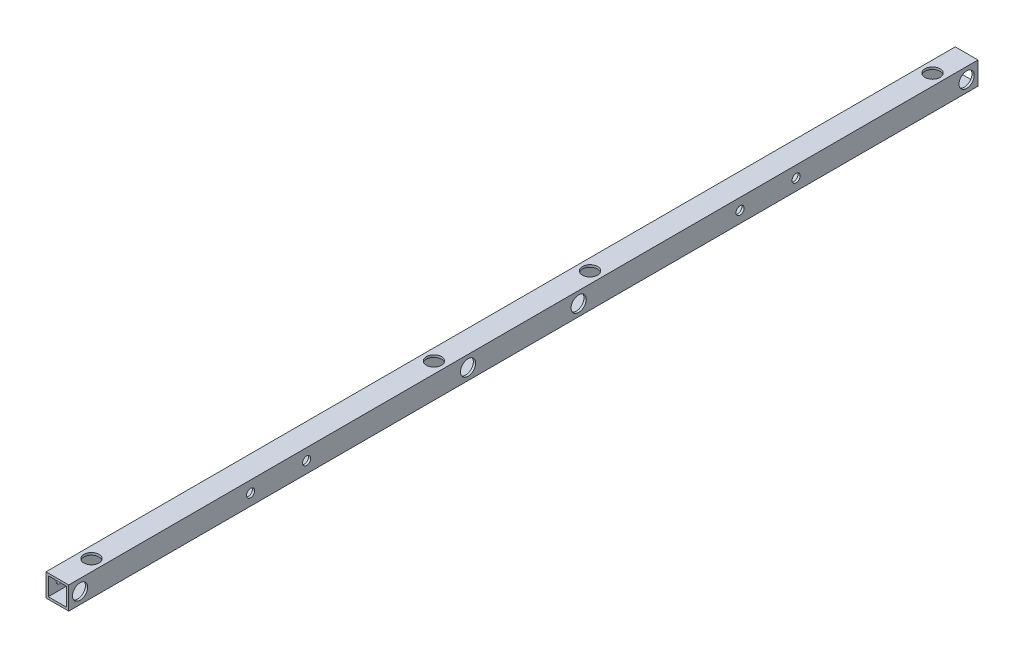
ISO-10303-21;
HEADER;
FILE_DESCRIPTION(('STEP AP214'),'2;1');
FILE_NAME('part.step','',(''),(''),'','','');
FILE_SCHEMA(('AUTOMOTIVE_DESIGN { 1 0 10303 214 1 1 1 1 }'));
ENDSEC;
DATA;
#1=APPLICATION_CONTEXT('core data for automotive mechanical design processes');
#2=APPLICATION_PROTOCOL_DEFINITION('international standard','automotive_design',2000,#1);
#3=PRODUCT_CONTEXT('',#1,'mechanical');
#4=PRODUCT('Part','Part','',(#3));
#5=PRODUCT_RELATED_PRODUCT_CATEGORY('part','',(#4));
#6=PRODUCT_DEFINITION_FORMATION('','',#4);
#7=PRODUCT_DEFINITION_CONTEXT('part definition',#1,'design');
#8=PRODUCT_DEFINITION('design','',#6,#7);
#9=PRODUCT_DEFINITION_SHAPE('','',#8);
#10=(LENGTH_UNIT() NAMED_UNIT(*) SI_UNIT(.MILLI.,.METRE.));
#11=(NAMED_UNIT(*) PLANE_ANGLE_UNIT() SI_UNIT($,.RADIAN.));
#12=(NAMED_UNIT(*) SI_UNIT($,.STERADIAN.) SOLID_ANGLE_UNIT());
#13=UNCERTAINTY_MEASURE_WITH_UNIT(LENGTH_MEASURE(1.E-05),#10,'distance_accuracy_value','');
#14=(GEOMETRIC_REPRESENTATION_CONTEXT(3) GLOBAL_UNCERTAINTY_ASSIGNED_CONTEXT((#13)) GLOBAL_UNIT_ASSIGNED_CONTEXT((#10,
#11,#12)) REPRESENTATION_CONTEXT('',''));
#15=CARTESIAN_POINT('',(0.,0.,0.));
#16=DIRECTION('',(0.,0.,1.));
#17=DIRECTION('',(1.,0.,0.));
#18=AXIS2_PLACEMENT_3D('',#15,#16,#17);
#19=CARTESIAN_POINT('',(0.,0.,600.));
#20=DIRECTION('',(0.,0.,-1.));
#21=DIRECTION('',(-1.,0.,0.));
#22=AXIS2_PLACEMENT_3D('',#19,#20,#21);
#23=PLANE('',#22);
#24=DIRECTION('',(0.,1.,0.));
#25=VECTOR('',#24,1.);
#26=CARTESIAN_POINT('',(7.5,-7.5,600.));
#27=LINE('',#26,#25);
#28=CARTESIAN_POINT('',(7.5,-7.5,600.));
#29=VERTEX_POINT('',#28);
#30=CARTESIAN_POINT('',(7.5,7.5,600.));
#31=VERTEX_POINT('',#30);
#32=EDGE_CURVE('E158',#29,#31,#27,.T.);
#33=ORIENTED_EDGE('',*,*,#32,.T.);
#34=DIRECTION('',(-1.,0.,0.));
#35=VECTOR('',#34,1.);
#36=CARTESIAN_POINT('',(-7.5,7.5,600.));
#37=LINE('',#36,#35);
#38=CARTESIAN_POINT('',(-7.5,7.5,600.));
#39=VERTEX_POINT('',#38);
#40=EDGE_CURVE('E161',#31,#39,#37,.T.);
#41=ORIENTED_EDGE('',*,*,#40,.T.);
#42=DIRECTION('',(0.,-1.,0.));
#43=VECTOR('',#42,1.);
#44=CARTESIAN_POINT('',(-7.5,-7.5,600.));
#45=LINE('',#44,#43);
#46=CARTESIAN_POINT('',(-7.5,-7.5,600.));
#47=VERTEX_POINT('',#46);
#48=EDGE_CURVE('E164',#39,#47,#45,.T.);
#49=ORIENTED_EDGE('',*,*,#48,.T.);
#50=DIRECTION('',(1.,0.,0.));
#51=VECTOR('',#50,1.);
#52=CARTESIAN_POINT('',(-7.5,-7.5,600.));
#53=LINE('',#52,#51);
#54=EDGE_CURVE('E166',#47,#29,#53,.T.);
#55=ORIENTED_EDGE('',*,*,#54,.T.);
#56=EDGE_LOOP('',(#33,#41,#49,#55));
#57=FACE_BOUND('',#56,.T.);
#58=DIRECTION('',(0.,1.,0.));
#59=VECTOR('',#58,1.);
#60=CARTESIAN_POINT('',(6.,-6.,600.));
#61=LINE('',#60,#59);
#62=CARTESIAN_POINT('',(6.,-6.,600.));
#63=VERTEX_POINT('',#62);
#64=CARTESIAN_POINT('',(6.,6.,600.));
#65=VERTEX_POINT('',#64);
#66=EDGE_CURVE('E120',#63,#65,#61,.T.);
#67=ORIENTED_EDGE('',*,*,#66,.F.);
#68=DIRECTION('',(1.,0.,0.));
#69=VECTOR('',#68,1.);
#70=CARTESIAN_POINT('',(-6.,-6.,600.));
#71=LINE('',#70,#69);
#72=CARTESIAN_POINT('',(-6.,-6.,600.));
#73=VERTEX_POINT('',#72);
#74=EDGE_CURVE('E142',#73,#63,#71,.T.);
#75=ORIENTED_EDGE('',*,*,#74,.F.);
#76=DIRECTION('',(0.,-1.,0.));
#77=VECTOR('',#76,1.);
#78=CARTESIAN_POINT('',(-6.,-6.,600.));
#79=LINE('',#78,#77);
#80=CARTESIAN_POINT('',(-6.,6.,600.));
#81=VERTEX_POINT('',#80);
#82=EDGE_CURVE('E140',#81,#73,#79,.T.);
#83=ORIENTED_EDGE('',*,*,#82,.F.);
#84=DIRECTION('',(-1.,0.,0.));
#85=VECTOR('',#84,1.);
#86=CARTESIAN_POINT('',(-6.,6.,600.));
#87=LINE('',#86,#85);
#88=EDGE_CURVE('E128',#65,#81,#87,.T.);
#89=ORIENTED_EDGE('',*,*,#88,.F.);
#90=EDGE_LOOP('',(#67,#75,#83,#89));
#91=FACE_BOUND('',#90,.T.);
#92=ADVANCED_FACE('F53',(#57,#91),#23,.F.);
#93=CARTESIAN_POINT('',(0.,0.,0.));
#94=DIRECTION('',(0.,0.,-1.));
#95=DIRECTION('',(-1.,0.,0.));
#96=AXIS2_PLACEMENT_3D('',#93,#94,#95);
#97=PLANE('',#96);
#98=DIRECTION('',(0.,1.,0.));
#99=VECTOR('',#98,1.);
#100=CARTESIAN_POINT('',(7.5,-7.5,0.));
#101=LINE('',#100,#99);
#102=CARTESIAN_POINT('',(7.5,-7.5,0.));
#103=VERTEX_POINT('',#102);
#104=CARTESIAN_POINT('',(7.5,7.5,0.));
#105=VERTEX_POINT('',#104);
#106=EDGE_CURVE('E136',#103,#105,#101,.T.);
#107=ORIENTED_EDGE('',*,*,#106,.F.);
#108=DIRECTION('',(1.,0.,0.));
#109=VECTOR('',#108,1.);
#110=CARTESIAN_POINT('',(-7.5,-7.5,0.));
#111=LINE('',#110,#109);
#112=CARTESIAN_POINT('',(-7.5,-7.5,0.));
#113=VERTEX_POINT('',#112);
#114=EDGE_CURVE('E162',#113,#103,#111,.T.);
#115=ORIENTED_EDGE('',*,*,#114,.F.);
#116=DIRECTION('',(0.,-1.,0.));
#117=VECTOR('',#116,1.);
#118=CARTESIAN_POINT('',(-7.5,-7.5,0.));
#119=LINE('',#118,#117);
#120=CARTESIAN_POINT('',(-7.5,7.5,0.));
#121=VERTEX_POINT('',#120);
#122=EDGE_CURVE('E173',#121,#113,#119,.T.);
#123=ORIENTED_EDGE('',*,*,#122,.F.);
#124=DIRECTION('',(-1.,0.,0.));
#125=VECTOR('',#124,1.);
#126=CARTESIAN_POINT('',(-7.5,7.5,0.));
#127=LINE('',#126,#125);
#128=EDGE_CURVE('E171',#105,#121,#127,.T.);
#129=ORIENTED_EDGE('',*,*,#128,.F.);
#130=EDGE_LOOP('',(#107,#115,#123,#129));
#131=FACE_BOUND('',#130,.T.);
#132=DIRECTION('',(1.,0.,0.));
#133=VECTOR('',#132,1.);
#134=CARTESIAN_POINT('',(-6.,-6.,0.));
#135=LINE('',#134,#133);
#136=CARTESIAN_POINT('',(-6.,-6.,0.));
#137=VERTEX_POINT('',#136);
#138=CARTESIAN_POINT('',(6.,-6.,0.));
#139=VERTEX_POINT('',#138);
#140=EDGE_CURVE('E129',#137,#139,#135,.T.);
#141=ORIENTED_EDGE('',*,*,#140,.T.);
#142=DIRECTION('',(0.,1.,0.));
#143=VECTOR('',#142,1.);
#144=CARTESIAN_POINT('',(6.,-6.,0.));
#145=LINE('',#144,#143);
#146=CARTESIAN_POINT('',(6.,6.,0.));
#147=VERTEX_POINT('',#146);
#148=EDGE_CURVE('E78',#139,#147,#145,.T.);
#149=ORIENTED_EDGE('',*,*,#148,.T.);
#150=DIRECTION('',(-1.,0.,0.));
#151=VECTOR('',#150,1.);
#152=CARTESIAN_POINT('',(-6.,6.,0.));
#153=LINE('',#152,#151);
#154=CARTESIAN_POINT('',(-6.,6.,0.));
#155=VERTEX_POINT('',#154);
#156=EDGE_CURVE('E135',#147,#155,#153,.T.);
#157=ORIENTED_EDGE('',*,*,#156,.T.);
#158=DIRECTION('',(0.,-1.,0.));
#159=VECTOR('',#158,1.);
#160=CARTESIAN_POINT('',(-6.,-6.,0.));
#161=LINE('',#160,#159);
#162=EDGE_CURVE('E150',#155,#137,#161,.T.);
#163=ORIENTED_EDGE('',*,*,#162,.T.);
#164=EDGE_LOOP('',(#141,#149,#157,#163));
#165=FACE_BOUND('',#164,.T.);
#166=ADVANCED_FACE('F336',(#131,#165),#97,.T.);
#167=CARTESIAN_POINT('',(7.5,-7.5,600.));
#168=DIRECTION('',(-1.,0.,0.));
#169=DIRECTION('',(0.,0.,1.));
#170=AXIS2_PLACEMENT_3D('',#167,#168,#169);
#171=PLANE('',#170);
#172=CARTESIAN_POINT('',(7.5,0.,480.));
#173=DIRECTION('',(1.,0.,0.));
#174=DIRECTION('',(0.,0.,-1.));
#175=AXIS2_PLACEMENT_3D('',#172,#173,#174);
#176=CIRCLE('',#175,2.69999999999996);
#177=CARTESIAN_POINT('',(7.5,0.,477.3));
#178=VERTEX_POINT('',#177);
#179=EDGE_CURVE('E269',#178,#178,#176,.T.);
#180=ORIENTED_EDGE('',*,*,#179,.F.);
#181=EDGE_LOOP('',(#180));
#182=FACE_BOUND('',#181,.T.);
#183=CARTESIAN_POINT('',(7.5,0.,443.));
#184=DIRECTION('',(1.,0.,0.));
#185=DIRECTION('',(0.,0.,-1.));
#186=AXIS2_PLACEMENT_3D('',#183,#184,#185);
#187=CIRCLE('',#186,2.69999999999996);
#188=CARTESIAN_POINT('',(7.5,0.,440.3));
#189=VERTEX_POINT('',#188);
#190=EDGE_CURVE('E261',#189,#189,#187,.T.);
#191=ORIENTED_EDGE('',*,*,#190,.F.);
#192=EDGE_LOOP('',(#191));
#193=FACE_BOUND('',#192,.T.);
#194=CARTESIAN_POINT('',(7.5,0.,157.));
#195=DIRECTION('',(1.,0.,0.));
#196=DIRECTION('',(0.,0.,-1.));
#197=AXIS2_PLACEMENT_3D('',#194,#195,#196);
#198=CIRCLE('',#197,2.70000000000001);
#199=CARTESIAN_POINT('',(7.5,0.,154.3));
#200=VERTEX_POINT('',#199);
#201=EDGE_CURVE('E256',#200,#200,#198,.T.);
#202=ORIENTED_EDGE('',*,*,#201,.F.);
#203=EDGE_LOOP('',(#202));
#204=FACE_BOUND('',#203,.T.);
#205=CARTESIAN_POINT('',(7.5,0.,120.));
#206=DIRECTION('',(1.,0.,0.));
#207=DIRECTION('',(0.,0.,-1.));
#208=AXIS2_PLACEMENT_3D('',#205,#206,#207);
#209=CIRCLE('',#208,2.7);
#210=CARTESIAN_POINT('',(7.5,0.,117.3));
#211=VERTEX_POINT('',#210);
#212=EDGE_CURVE('E252',#211,#211,#209,.T.);
#213=ORIENTED_EDGE('',*,*,#212,.F.);
#214=EDGE_LOOP('',(#213));
#215=FACE_BOUND('',#214,.T.);
#216=CARTESIAN_POINT('',(7.5,0.,592.5));
#217=DIRECTION('',(1.,0.,0.));
#218=DIRECTION('',(0.,0.,-1.));
#219=AXIS2_PLACEMENT_3D('',#216,#217,#218);
#220=CIRCLE('',#219,5.00000000000004);
#221=CARTESIAN_POINT('',(7.5,0.,587.5));
#222=VERTEX_POINT('',#221);
#223=EDGE_CURVE('E231',#222,#222,#220,.T.);
#224=ORIENTED_EDGE('',*,*,#223,.F.);
#225=EDGE_LOOP('',(#224));
#226=FACE_BOUND('',#225,.T.);
#227=CARTESIAN_POINT('',(7.5,0.,336.5));
#228=DIRECTION('',(1.,0.,0.));
#229=DIRECTION('',(0.,0.,-1.));
#230=AXIS2_PLACEMENT_3D('',#227,#228,#229);
#231=CIRCLE('',#230,4.99999999999999);
#232=CARTESIAN_POINT('',(7.5,0.,331.5));
#233=VERTEX_POINT('',#232);
#234=EDGE_CURVE('E281',#233,#233,#231,.T.);
#235=ORIENTED_EDGE('',*,*,#234,.F.);
#236=EDGE_LOOP('',(#235));
#237=FACE_BOUND('',#236,.T.);
#238=CARTESIAN_POINT('',(7.5,0.,263.5));
#239=DIRECTION('',(1.,0.,0.));
#240=DIRECTION('',(0.,0.,-1.));
#241=AXIS2_PLACEMENT_3D('',#238,#239,#240);
#242=CIRCLE('',#241,4.99999999999999);
#243=CARTESIAN_POINT('',(7.5,0.,258.5));
#244=VERTEX_POINT('',#243);
#245=EDGE_CURVE('E284',#244,#244,#242,.T.);
#246=ORIENTED_EDGE('',*,*,#245,.F.);
#247=EDGE_LOOP('',(#246));
#248=FACE_BOUND('',#247,.T.);
#249=CARTESIAN_POINT('',(7.5,0.,7.5));
#250=DIRECTION('',(1.,0.,0.));
#251=DIRECTION('',(0.,0.,-1.));
#252=AXIS2_PLACEMENT_3D('',#249,#250,#251);
#253=CIRCLE('',#252,5.);
#254=CARTESIAN_POINT('',(7.5,0.,2.5));
#255=VERTEX_POINT('',#254);
#256=EDGE_CURVE('E278',#255,#255,#253,.T.);
#257=ORIENTED_EDGE('',*,*,#256,.F.);
#258=EDGE_LOOP('',(#257));
#259=FACE_BOUND('',#258,.T.);
#260=ORIENTED_EDGE('',*,*,#106,.T.);
#261=DIRECTION('',(0.,0.,-1.));
#262=VECTOR('',#261,1.);
#263=CARTESIAN_POINT('',(7.5,7.5,600.));
#264=LINE('',#263,#262);
#265=EDGE_CURVE('E13',#31,#105,#264,.T.);
#266=ORIENTED_EDGE('',*,*,#265,.F.);
#267=ORIENTED_EDGE('',*,*,#32,.F.);
#268=DIRECTION('',(0.,0.,-1.));
#269=VECTOR('',#268,1.);
#270=CARTESIAN_POINT('',(7.5,-7.5,600.));
#271=LINE('',#270,#269);
#272=EDGE_CURVE('E168',#29,#103,#271,.T.);
#273=ORIENTED_EDGE('',*,*,#272,.T.);
#274=EDGE_LOOP('',(#260,#266,#267,#273));
#275=FACE_BOUND('',#274,.T.);
#276=ADVANCED_FACE('F55',(#182,#193,#204,#215,#226,#237,#248,#259,#275),#171,.F.);
#277=CARTESIAN_POINT('',(-7.5,7.5,600.));
#278=DIRECTION('',(0.,-1.,0.));
#279=DIRECTION('',(0.,0.,-1.));
#280=AXIS2_PLACEMENT_3D('',#277,#278,#279);
#281=PLANE('',#280);
#282=CARTESIAN_POINT('',(0.,7.5,577.5));
#283=DIRECTION('',(0.,1.,0.));
#284=DIRECTION('',(0.,0.,1.));
#285=AXIS2_PLACEMENT_3D('',#282,#283,#284);
#286=CIRCLE('',#285,5.);
#287=CARTESIAN_POINT('',(0.,7.5,582.5));
#288=VERTEX_POINT('',#287);
#289=EDGE_CURVE('E219',#288,#288,#286,.T.);
#290=ORIENTED_EDGE('',*,*,#289,.F.);
#291=EDGE_LOOP('',(#290));
#292=FACE_BOUND('',#291,.T.);
#293=CARTESIAN_POINT('',(-7.75236273748183E-13,7.5,351.5));
#294=DIRECTION('',(0.,1.,0.));
#295=DIRECTION('',(0.,0.,1.));
#296=AXIS2_PLACEMENT_3D('',#293,#294,#295);
#297=CIRCLE('',#296,5.);
#298=CARTESIAN_POINT('',(-7.75236273748183E-13,7.5,356.5));
#299=VERTEX_POINT('',#298);
#300=EDGE_CURVE('E291',#299,#299,#297,.T.);
#301=ORIENTED_EDGE('',*,*,#300,.F.);
#302=EDGE_LOOP('',(#301));
#303=FACE_BOUND('',#302,.T.);
#304=CARTESIAN_POINT('',(7.7497107641725E-13,7.5,248.5));
#305=DIRECTION('',(0.,1.,0.));
#306=DIRECTION('',(0.,0.,1.));
#307=AXIS2_PLACEMENT_3D('',#304,#305,#306);
#308=CIRCLE('',#307,5.);
#309=CARTESIAN_POINT('',(7.7497107641725E-13,7.5,253.5));
#310=VERTEX_POINT('',#309);
#311=EDGE_CURVE('E294',#310,#310,#308,.T.);
#312=ORIENTED_EDGE('',*,*,#311,.F.);
#313=EDGE_LOOP('',(#312));
#314=FACE_BOUND('',#313,.T.);
#315=CARTESIAN_POINT('',(0.,7.5,22.5));
#316=DIRECTION('',(0.,1.,0.));
#317=DIRECTION('',(0.,0.,1.));
#318=AXIS2_PLACEMENT_3D('',#315,#316,#317);
#319=CIRCLE('',#318,5.);
#320=CARTESIAN_POINT('',(0.,7.5,27.5));
#321=VERTEX_POINT('',#320);
#322=EDGE_CURVE('E240',#321,#321,#319,.T.);
#323=ORIENTED_EDGE('',*,*,#322,.F.);
#324=EDGE_LOOP('',(#323));
#325=FACE_BOUND('',#324,.T.);
#326=ORIENTED_EDGE('',*,*,#128,.T.);
#327=DIRECTION('',(0.,0.,-1.));
#328=VECTOR('',#327,1.);
#329=CARTESIAN_POINT('',(-7.5,7.5,600.));
#330=LINE('',#329,#328);
#331=EDGE_CURVE('E62',#39,#121,#330,.T.);
#332=ORIENTED_EDGE('',*,*,#331,.F.);
#333=ORIENTED_EDGE('',*,*,#40,.F.);
#334=ORIENTED_EDGE('',*,*,#265,.T.);
#335=EDGE_LOOP('',(#326,#332,#333,#334));
#336=FACE_BOUND('',#335,.T.);
#337=ADVANCED_FACE('F351',(#292,#303,#314,#325,#336),#281,.F.);
#338=CARTESIAN_POINT('',(-7.5,-7.5,600.));
#339=DIRECTION('',(1.,0.,0.));
#340=DIRECTION('',(0.,0.,-1.));
#341=AXIS2_PLACEMENT_3D('',#338,#339,#340);
#342=PLANE('',#341);
#343=CARTESIAN_POINT('',(-7.5,0.,120.));
#344=DIRECTION('',(-1.,0.,0.));
#345=DIRECTION('',(0.,0.,1.));
#346=AXIS2_PLACEMENT_3D('',#343,#344,#345);
#347=CIRCLE('',#346,5.);
#348=CARTESIAN_POINT('',(-7.5,0.,125.));
#349=VERTEX_POINT('',#348);
#350=EDGE_CURVE('E245',#349,#349,#347,.T.);
#351=ORIENTED_EDGE('',*,*,#350,.F.);
#352=EDGE_LOOP('',(#351));
#353=FACE_BOUND('',#352,.T.);
#354=CARTESIAN_POINT('',(-7.5,0.,157.));
#355=DIRECTION('',(-1.,0.,0.));
#356=DIRECTION('',(0.,0.,1.));
#357=AXIS2_PLACEMENT_3D('',#354,#355,#356);
#358=CIRCLE('',#357,4.99999999999999);
#359=CARTESIAN_POINT('',(-7.5,0.,162.));
#360=VERTEX_POINT('',#359);
#361=EDGE_CURVE('E612',#360,#360,#358,.T.);
#362=ORIENTED_EDGE('',*,*,#361,.F.);
#363=EDGE_LOOP('',(#362));
#364=FACE_BOUND('',#363,.T.);
#365=CARTESIAN_POINT('',(-7.5,0.,443.));
#366=DIRECTION('',(-1.,0.,0.));
#367=DIRECTION('',(0.,0.,1.));
#368=AXIS2_PLACEMENT_3D('',#365,#366,#367);
#369=CIRCLE('',#368,4.99999999999999);
#370=CARTESIAN_POINT('',(-7.5,0.,448.));
#371=VERTEX_POINT('',#370);
#372=EDGE_CURVE('E615',#371,#371,#369,.T.);
#373=ORIENTED_EDGE('',*,*,#372,.F.);
#374=EDGE_LOOP('',(#373));
#375=FACE_BOUND('',#374,.T.);
#376=CARTESIAN_POINT('',(-7.5,0.,480.));
#377=DIRECTION('',(-1.,0.,0.));
#378=DIRECTION('',(0.,0.,1.));
#379=AXIS2_PLACEMENT_3D('',#376,#377,#378);
#380=CIRCLE('',#379,4.99999999999999);
#381=CARTESIAN_POINT('',(-7.5,0.,485.));
#382=VERTEX_POINT('',#381);
#383=EDGE_CURVE('E620',#382,#382,#380,.T.);
#384=ORIENTED_EDGE('',*,*,#383,.F.);
#385=EDGE_LOOP('',(#384));
#386=FACE_BOUND('',#385,.T.);
#387=CARTESIAN_POINT('',(-7.5,0.,592.5));
#388=DIRECTION('',(1.,0.,0.));
#389=DIRECTION('',(0.,0.,-1.));
#390=AXIS2_PLACEMENT_3D('',#387,#388,#389);
#391=CIRCLE('',#390,2.25000000000001);
#392=CARTESIAN_POINT('',(-7.5,0.,590.25));
#393=VERTEX_POINT('',#392);
#394=EDGE_CURVE('E148',#393,#393,#391,.T.);
#395=ORIENTED_EDGE('',*,*,#394,.T.);
#396=EDGE_LOOP('',(#395));
#397=FACE_BOUND('',#396,.T.);
#398=CARTESIAN_POINT('',(-7.5,0.,263.5));
#399=DIRECTION('',(1.,0.,0.));
#400=DIRECTION('',(0.,0.,-1.));
#401=AXIS2_PLACEMENT_3D('',#398,#399,#400);
#402=CIRCLE('',#401,2.24999999999995);
#403=CARTESIAN_POINT('',(-7.5,0.,261.25));
#404=VERTEX_POINT('',#403);
#405=EDGE_CURVE('E195',#404,#404,#402,.T.);
#406=ORIENTED_EDGE('',*,*,#405,.T.);
#407=EDGE_LOOP('',(#406));
#408=FACE_BOUND('',#407,.T.);
#409=CARTESIAN_POINT('',(-7.5,0.,7.5));
#410=DIRECTION('',(1.,0.,0.));
#411=DIRECTION('',(0.,0.,-1.));
#412=AXIS2_PLACEMENT_3D('',#409,#410,#411);
#413=CIRCLE('',#412,2.25);
#414=CARTESIAN_POINT('',(-7.5,0.,5.25));
#415=VERTEX_POINT('',#414);
#416=EDGE_CURVE('E191',#415,#415,#413,.T.);
#417=ORIENTED_EDGE('',*,*,#416,.T.);
#418=EDGE_LOOP('',(#417));
#419=FACE_BOUND('',#418,.T.);
#420=CARTESIAN_POINT('',(-7.5,0.,336.5));
#421=DIRECTION('',(1.,0.,0.));
#422=DIRECTION('',(0.,0.,-1.));
#423=AXIS2_PLACEMENT_3D('',#420,#421,#422);
#424=CIRCLE('',#423,2.24999999999995);
#425=CARTESIAN_POINT('',(-7.5,0.,334.25));
#426=VERTEX_POINT('',#425);
#427=EDGE_CURVE('E186',#426,#426,#424,.T.);
#428=ORIENTED_EDGE('',*,*,#427,.T.);
#429=EDGE_LOOP('',(#428));
#430=FACE_BOUND('',#429,.T.);
#431=ORIENTED_EDGE('',*,*,#122,.T.);
#432=DIRECTION('',(0.,0.,-1.));
#433=VECTOR('',#432,1.);
#434=CARTESIAN_POINT('',(-7.5,-7.5,600.));
#435=LINE('',#434,#433);
#436=EDGE_CURVE('E178',#47,#113,#435,.T.);
#437=ORIENTED_EDGE('',*,*,#436,.F.);
#438=ORIENTED_EDGE('',*,*,#48,.F.);
#439=ORIENTED_EDGE('',*,*,#331,.T.);
#440=EDGE_LOOP('',(#431,#437,#438,#439));
#441=FACE_BOUND('',#440,.T.);
#442=ADVANCED_FACE('F315',(#353,#364,#375,#386,#397,#408,#419,#430,#441),#342,.F.);
#443=CARTESIAN_POINT('',(-7.5,-7.5,600.));
#444=DIRECTION('',(0.,1.,0.));
#445=DIRECTION('',(0.,0.,1.));
#446=AXIS2_PLACEMENT_3D('',#443,#444,#445);
#447=PLANE('',#446);
#448=CARTESIAN_POINT('',(0.,-7.5,577.5));
#449=DIRECTION('',(0.,1.,0.));
#450=DIRECTION('',(0.,0.,1.));
#451=AXIS2_PLACEMENT_3D('',#448,#449,#450);
#452=CIRCLE('',#451,2.24999999999998);
#453=CARTESIAN_POINT('',(0.,-7.5,579.75));
#454=VERTEX_POINT('',#453);
#455=EDGE_CURVE('E187',#454,#454,#452,.T.);
#456=ORIENTED_EDGE('',*,*,#455,.T.);
#457=EDGE_LOOP('',(#456));
#458=FACE_BOUND('',#457,.T.);
#459=CARTESIAN_POINT('',(0.,-7.5,22.5));
#460=DIRECTION('',(0.,1.,0.));
#461=DIRECTION('',(0.,0.,1.));
#462=AXIS2_PLACEMENT_3D('',#459,#460,#461);
#463=CIRCLE('',#462,2.25);
#464=CARTESIAN_POINT('',(0.,-7.5,24.75));
#465=VERTEX_POINT('',#464);
#466=EDGE_CURVE('E211',#465,#465,#463,.T.);
#467=ORIENTED_EDGE('',*,*,#466,.T.);
#468=EDGE_LOOP('',(#467));
#469=FACE_BOUND('',#468,.T.);
#470=CARTESIAN_POINT('',(7.7497107641725E-13,-7.5,248.5));
#471=DIRECTION('',(0.,1.,0.));
#472=DIRECTION('',(0.,0.,1.));
#473=AXIS2_PLACEMENT_3D('',#470,#471,#472);
#474=CIRCLE('',#473,2.25);
#475=CARTESIAN_POINT('',(7.7497107641725E-13,-7.5,250.75));
#476=VERTEX_POINT('',#475);
#477=EDGE_CURVE('E207',#476,#476,#474,.T.);
#478=ORIENTED_EDGE('',*,*,#477,.T.);
#479=EDGE_LOOP('',(#478));
#480=FACE_BOUND('',#479,.T.);
#481=CARTESIAN_POINT('',(-7.75236273748183E-13,-7.5,351.5));
#482=DIRECTION('',(0.,1.,0.));
#483=DIRECTION('',(0.,0.,1.));
#484=AXIS2_PLACEMENT_3D('',#481,#482,#483);
#485=CIRCLE('',#484,2.25);
#486=CARTESIAN_POINT('',(-7.75236273748183E-13,-7.5,353.75));
#487=VERTEX_POINT('',#486);
#488=EDGE_CURVE('E202',#487,#487,#485,.T.);
#489=ORIENTED_EDGE('',*,*,#488,.T.);
#490=EDGE_LOOP('',(#489));
#491=FACE_BOUND('',#490,.T.);
#492=ORIENTED_EDGE('',*,*,#114,.T.);
#493=ORIENTED_EDGE('',*,*,#272,.F.);
#494=ORIENTED_EDGE('',*,*,#54,.F.);
#495=ORIENTED_EDGE('',*,*,#436,.T.);
#496=EDGE_LOOP('',(#492,#493,#494,#495));
#497=FACE_BOUND('',#496,.T.);
#498=ADVANCED_FACE('F347',(#458,#469,#480,#491,#497),#447,.F.);
#499=CARTESIAN_POINT('',(6.,-6.,600.));
#500=DIRECTION('',(-1.,0.,0.));
#501=DIRECTION('',(0.,0.,1.));
#502=AXIS2_PLACEMENT_3D('',#499,#500,#501);
#503=PLANE('',#502);
#504=CARTESIAN_POINT('',(6.,0.,480.));
#505=DIRECTION('',(-1.,0.,0.));
#506=DIRECTION('',(0.,0.,1.));
#507=AXIS2_PLACEMENT_3D('',#504,#505,#506);
#508=CIRCLE('',#507,2.69999999999996);
#509=CARTESIAN_POINT('',(6.,0.,482.7));
#510=VERTEX_POINT('',#509);
#511=EDGE_CURVE('E275',#510,#510,#508,.T.);
#512=ORIENTED_EDGE('',*,*,#511,.F.);
#513=EDGE_LOOP('',(#512));
#514=FACE_BOUND('',#513,.T.);
#515=CARTESIAN_POINT('',(6.,0.,443.));
#516=DIRECTION('',(-1.,0.,0.));
#517=DIRECTION('',(0.,0.,1.));
#518=AXIS2_PLACEMENT_3D('',#515,#516,#517);
#519=CIRCLE('',#518,2.69999999999996);
#520=CARTESIAN_POINT('',(6.,0.,445.7));
#521=VERTEX_POINT('',#520);
#522=EDGE_CURVE('E272',#521,#521,#519,.T.);
#523=ORIENTED_EDGE('',*,*,#522,.F.);
#524=EDGE_LOOP('',(#523));
#525=FACE_BOUND('',#524,.T.);
#526=CARTESIAN_POINT('',(6.,0.,157.));
#527=DIRECTION('',(-1.,0.,0.));
#528=DIRECTION('',(0.,0.,1.));
#529=AXIS2_PLACEMENT_3D('',#526,#527,#528);
#530=CIRCLE('',#529,2.70000000000001);
#531=CARTESIAN_POINT('',(6.,0.,159.7));
#532=VERTEX_POINT('',#531);
#533=EDGE_CURVE('E268',#532,#532,#530,.T.);
#534=ORIENTED_EDGE('',*,*,#533,.F.);
#535=EDGE_LOOP('',(#534));
#536=FACE_BOUND('',#535,.T.);
#537=CARTESIAN_POINT('',(6.,0.,120.));
#538=DIRECTION('',(-1.,0.,0.));
#539=DIRECTION('',(0.,0.,1.));
#540=AXIS2_PLACEMENT_3D('',#537,#538,#539);
#541=CIRCLE('',#540,2.7);
#542=CARTESIAN_POINT('',(6.,0.,122.7));
#543=VERTEX_POINT('',#542);
#544=EDGE_CURVE('E265',#543,#543,#541,.T.);
#545=ORIENTED_EDGE('',*,*,#544,.F.);
#546=EDGE_LOOP('',(#545));
#547=FACE_BOUND('',#546,.T.);
#548=CARTESIAN_POINT('',(6.,0.,592.5));
#549=DIRECTION('',(-1.,0.,0.));
#550=DIRECTION('',(0.,0.,1.));
#551=AXIS2_PLACEMENT_3D('',#548,#549,#550);
#552=CIRCLE('',#551,5.00000000000004);
#553=CARTESIAN_POINT('',(6.,0.,597.5));
#554=VERTEX_POINT('',#553);
#555=EDGE_CURVE('E237',#554,#554,#552,.T.);
#556=ORIENTED_EDGE('',*,*,#555,.F.);
#557=EDGE_LOOP('',(#556));
#558=FACE_BOUND('',#557,.T.);
#559=CARTESIAN_POINT('',(6.,0.,336.5));
#560=DIRECTION('',(-1.,0.,0.));
#561=DIRECTION('',(0.,0.,1.));
#562=AXIS2_PLACEMENT_3D('',#559,#560,#561);
#563=CIRCLE('',#562,4.99999999999999);
#564=CARTESIAN_POINT('',(6.,0.,341.5));
#565=VERTEX_POINT('',#564);
#566=EDGE_CURVE('E234',#565,#565,#563,.T.);
#567=ORIENTED_EDGE('',*,*,#566,.F.);
#568=EDGE_LOOP('',(#567));
#569=FACE_BOUND('',#568,.T.);
#570=CARTESIAN_POINT('',(6.,0.,263.5));
#571=DIRECTION('',(-1.,0.,0.));
#572=DIRECTION('',(0.,0.,1.));
#573=AXIS2_PLACEMENT_3D('',#570,#571,#572);
#574=CIRCLE('',#573,4.99999999999999);
#575=CARTESIAN_POINT('',(6.,0.,268.5));
#576=VERTEX_POINT('',#575);
#577=EDGE_CURVE('E230',#576,#576,#574,.T.);
#578=ORIENTED_EDGE('',*,*,#577,.F.);
#579=EDGE_LOOP('',(#578));
#580=FACE_BOUND('',#579,.T.);
#581=CARTESIAN_POINT('',(6.,0.,7.5));
#582=DIRECTION('',(-1.,0.,0.));
#583=DIRECTION('',(0.,0.,1.));
#584=AXIS2_PLACEMENT_3D('',#581,#582,#583);
#585=CIRCLE('',#584,5.);
#586=CARTESIAN_POINT('',(6.,0.,12.5));
#587=VERTEX_POINT('',#586);
#588=EDGE_CURVE('E227',#587,#587,#585,.T.);
#589=ORIENTED_EDGE('',*,*,#588,.F.);
#590=EDGE_LOOP('',(#589));
#591=FACE_BOUND('',#590,.T.);
#592=ORIENTED_EDGE('',*,*,#148,.F.);
#593=DIRECTION('',(0.,0.,-1.));
#594=VECTOR('',#593,1.);
#595=CARTESIAN_POINT('',(6.,-6.,600.));
#596=LINE('',#595,#594);
#597=EDGE_CURVE('E124',#63,#139,#596,.T.);
#598=ORIENTED_EDGE('',*,*,#597,.F.);
#599=ORIENTED_EDGE('',*,*,#66,.T.);
#600=DIRECTION('',(0.,0.,-1.));
#601=VECTOR('',#600,1.);
#602=CARTESIAN_POINT('',(6.,6.,600.));
#603=LINE('',#602,#601);
#604=EDGE_CURVE('E123',#65,#147,#603,.T.);
#605=ORIENTED_EDGE('',*,*,#604,.T.);
#606=EDGE_LOOP('',(#592,#598,#599,#605));
#607=FACE_BOUND('',#606,.T.);
#608=ADVANCED_FACE('F122',(#514,#525,#536,#547,#558,#569,#580,#591,#607),#503,.T.);
#609=CARTESIAN_POINT('',(-6.,6.,600.));
#610=DIRECTION('',(0.,-1.,0.));
#611=DIRECTION('',(0.,0.,-1.));
#612=AXIS2_PLACEMENT_3D('',#609,#610,#611);
#613=PLANE('',#612);
#614=CARTESIAN_POINT('',(0.,6.,577.5));
#615=DIRECTION('',(0.,-1.,0.));
#616=DIRECTION('',(0.,0.,-1.));
#617=AXIS2_PLACEMENT_3D('',#614,#615,#616);
#618=CIRCLE('',#617,5.);
#619=CARTESIAN_POINT('',(0.,6.,572.5));
#620=VERTEX_POINT('',#619);
#621=EDGE_CURVE('E203',#620,#620,#618,.T.);
#622=ORIENTED_EDGE('',*,*,#621,.F.);
#623=EDGE_LOOP('',(#622));
#624=FACE_BOUND('',#623,.T.);
#625=CARTESIAN_POINT('',(-7.75236273748183E-13,6.,351.5));
#626=DIRECTION('',(0.,-1.,0.));
#627=DIRECTION('',(0.,0.,-1.));
#628=AXIS2_PLACEMENT_3D('',#625,#626,#627);
#629=CIRCLE('',#628,5.);
#630=CARTESIAN_POINT('',(-7.75236273748183E-13,6.,346.5));
#631=VERTEX_POINT('',#630);
#632=EDGE_CURVE('E222',#631,#631,#629,.T.);
#633=ORIENTED_EDGE('',*,*,#632,.F.);
#634=EDGE_LOOP('',(#633));
#635=FACE_BOUND('',#634,.T.);
#636=CARTESIAN_POINT('',(7.7497107641725E-13,6.,248.5));
#637=DIRECTION('',(0.,-1.,0.));
#638=DIRECTION('',(0.,0.,-1.));
#639=AXIS2_PLACEMENT_3D('',#636,#637,#638);
#640=CIRCLE('',#639,5.);
#641=CARTESIAN_POINT('',(7.7497107641725E-13,6.,243.5));
#642=VERTEX_POINT('',#641);
#643=EDGE_CURVE('E218',#642,#642,#640,.T.);
#644=ORIENTED_EDGE('',*,*,#643,.F.);
#645=EDGE_LOOP('',(#644));
#646=FACE_BOUND('',#645,.T.);
#647=CARTESIAN_POINT('',(0.,6.,22.5));
#648=DIRECTION('',(0.,-1.,0.));
#649=DIRECTION('',(0.,0.,-1.));
#650=AXIS2_PLACEMENT_3D('',#647,#648,#649);
#651=CIRCLE('',#650,5.);
#652=CARTESIAN_POINT('',(0.,6.,17.5));
#653=VERTEX_POINT('',#652);
#654=EDGE_CURVE('E215',#653,#653,#651,.T.);
#655=ORIENTED_EDGE('',*,*,#654,.F.);
#656=EDGE_LOOP('',(#655));
#657=FACE_BOUND('',#656,.T.);
#658=ORIENTED_EDGE('',*,*,#156,.F.);
#659=ORIENTED_EDGE('',*,*,#604,.F.);
#660=ORIENTED_EDGE('',*,*,#88,.T.);
#661=DIRECTION('',(0.,0.,-1.));
#662=VECTOR('',#661,1.);
#663=CARTESIAN_POINT('',(-6.,6.,600.));
#664=LINE('',#663,#662);
#665=EDGE_CURVE('E137',#81,#155,#664,.T.);
#666=ORIENTED_EDGE('',*,*,#665,.T.);
#667=EDGE_LOOP('',(#658,#659,#660,#666));
#668=FACE_BOUND('',#667,.T.);
#669=ADVANCED_FACE('F132',(#624,#635,#646,#657,#668),#613,.T.);
#670=CARTESIAN_POINT('',(-6.,-6.,600.));
#671=DIRECTION('',(1.,0.,0.));
#672=DIRECTION('',(0.,0.,-1.));
#673=AXIS2_PLACEMENT_3D('',#670,#671,#672);
#674=PLANE('',#673);
#675=CARTESIAN_POINT('',(-6.,0.,120.));
#676=DIRECTION('',(1.,0.,0.));
#677=DIRECTION('',(0.,0.,-1.));
#678=AXIS2_PLACEMENT_3D('',#675,#676,#677);
#679=CIRCLE('',#678,5.);
#680=CARTESIAN_POINT('',(-6.,0.,115.));
#681=VERTEX_POINT('',#680);
#682=EDGE_CURVE('E57',#681,#681,#679,.T.);
#683=ORIENTED_EDGE('',*,*,#682,.F.);
#684=EDGE_LOOP('',(#683));
#685=FACE_BOUND('',#684,.T.);
#686=CARTESIAN_POINT('',(-6.,0.,157.));
#687=DIRECTION('',(1.,0.,0.));
#688=DIRECTION('',(0.,0.,-1.));
#689=AXIS2_PLACEMENT_3D('',#686,#687,#688);
#690=CIRCLE('',#689,4.99999999999999);
#691=CARTESIAN_POINT('',(-6.,0.,152.));
#692=VERTEX_POINT('',#691);
#693=EDGE_CURVE('E247',#692,#692,#690,.T.);
#694=ORIENTED_EDGE('',*,*,#693,.F.);
#695=EDGE_LOOP('',(#694));
#696=FACE_BOUND('',#695,.T.);
#697=CARTESIAN_POINT('',(-6.,0.,443.));
#698=DIRECTION('',(1.,0.,0.));
#699=DIRECTION('',(0.,0.,-1.));
#700=AXIS2_PLACEMENT_3D('',#697,#698,#699);
#701=CIRCLE('',#700,4.99999999999999);
#702=CARTESIAN_POINT('',(-6.,0.,438.));
#703=VERTEX_POINT('',#702);
#704=EDGE_CURVE('E244',#703,#703,#701,.T.);
#705=ORIENTED_EDGE('',*,*,#704,.F.);
#706=EDGE_LOOP('',(#705));
#707=FACE_BOUND('',#706,.T.);
#708=CARTESIAN_POINT('',(-6.,0.,480.));
#709=DIRECTION('',(1.,0.,0.));
#710=DIRECTION('',(0.,0.,-1.));
#711=AXIS2_PLACEMENT_3D('',#708,#709,#710);
#712=CIRCLE('',#711,4.99999999999999);
#713=CARTESIAN_POINT('',(-6.,0.,475.));
#714=VERTEX_POINT('',#713);
#715=EDGE_CURVE('E241',#714,#714,#712,.T.);
#716=ORIENTED_EDGE('',*,*,#715,.F.);
#717=EDGE_LOOP('',(#716));
#718=FACE_BOUND('',#717,.T.);
#719=CARTESIAN_POINT('',(-6.,0.,592.5));
#720=DIRECTION('',(1.,0.,0.));
#721=DIRECTION('',(0.,0.,-1.));
#722=AXIS2_PLACEMENT_3D('',#719,#720,#721);
#723=CIRCLE('',#722,2.25000000000001);
#724=CARTESIAN_POINT('',(-6.,0.,590.25));
#725=VERTEX_POINT('',#724);
#726=EDGE_CURVE('E196',#725,#725,#723,.T.);
#727=ORIENTED_EDGE('',*,*,#726,.F.);
#728=EDGE_LOOP('',(#727));
#729=FACE_BOUND('',#728,.T.);
#730=CARTESIAN_POINT('',(-6.,0.,263.5));
#731=DIRECTION('',(1.,0.,0.));
#732=DIRECTION('',(0.,0.,-1.));
#733=AXIS2_PLACEMENT_3D('',#730,#731,#732);
#734=CIRCLE('',#733,2.24999999999995);
#735=CARTESIAN_POINT('',(-6.,0.,261.25));
#736=VERTEX_POINT('',#735);
#737=EDGE_CURVE('E192',#736,#736,#734,.T.);
#738=ORIENTED_EDGE('',*,*,#737,.F.);
#739=EDGE_LOOP('',(#738));
#740=FACE_BOUND('',#739,.T.);
#741=CARTESIAN_POINT('',(-6.,0.,7.5));
#742=DIRECTION('',(1.,0.,0.));
#743=DIRECTION('',(0.,0.,-1.));
#744=AXIS2_PLACEMENT_3D('',#741,#742,#743);
#745=CIRCLE('',#744,2.25);
#746=CARTESIAN_POINT('',(-6.,0.,5.25));
#747=VERTEX_POINT('',#746);
#748=EDGE_CURVE('E188',#747,#747,#745,.T.);
#749=ORIENTED_EDGE('',*,*,#748,.F.);
#750=EDGE_LOOP('',(#749));
#751=FACE_BOUND('',#750,.T.);
#752=CARTESIAN_POINT('',(-6.,0.,336.5));
#753=DIRECTION('',(1.,0.,0.));
#754=DIRECTION('',(0.,0.,-1.));
#755=AXIS2_PLACEMENT_3D('',#752,#753,#754);
#756=CIRCLE('',#755,2.24999999999995);
#757=CARTESIAN_POINT('',(-6.,0.,334.25));
#758=VERTEX_POINT('',#757);
#759=EDGE_CURVE('E183',#758,#758,#756,.T.);
#760=ORIENTED_EDGE('',*,*,#759,.F.);
#761=EDGE_LOOP('',(#760));
#762=FACE_BOUND('',#761,.T.);
#763=ORIENTED_EDGE('',*,*,#162,.F.);
#764=ORIENTED_EDGE('',*,*,#665,.F.);
#765=ORIENTED_EDGE('',*,*,#82,.T.);
#766=DIRECTION('',(0.,0.,-1.));
#767=VECTOR('',#766,1.);
#768=CARTESIAN_POINT('',(-6.,-6.,600.));
#769=LINE('',#768,#767);
#770=EDGE_CURVE('E70',#73,#137,#769,.T.);
#771=ORIENTED_EDGE('',*,*,#770,.T.);
#772=EDGE_LOOP('',(#763,#764,#765,#771));
#773=FACE_BOUND('',#772,.T.);
#774=ADVANCED_FACE('F387',(#685,#696,#707,#718,#729,#740,#751,#762,#773),#674,.T.);
#775=CARTESIAN_POINT('',(-6.,-6.,600.));
#776=DIRECTION('',(0.,1.,0.));
#777=DIRECTION('',(0.,0.,1.));
#778=AXIS2_PLACEMENT_3D('',#775,#776,#777);
#779=PLANE('',#778);
#780=CARTESIAN_POINT('',(0.,-6.,577.5));
#781=DIRECTION('',(0.,1.,0.));
#782=DIRECTION('',(0.,0.,1.));
#783=AXIS2_PLACEMENT_3D('',#780,#781,#782);
#784=CIRCLE('',#783,2.24999999999998);
#785=CARTESIAN_POINT('',(0.,-6.,579.75));
#786=VERTEX_POINT('',#785);
#787=EDGE_CURVE('E212',#786,#786,#784,.T.);
#788=ORIENTED_EDGE('',*,*,#787,.F.);
#789=EDGE_LOOP('',(#788));
#790=FACE_BOUND('',#789,.T.);
#791=CARTESIAN_POINT('',(0.,-6.,22.5));
#792=DIRECTION('',(0.,1.,0.));
#793=DIRECTION('',(0.,0.,1.));
#794=AXIS2_PLACEMENT_3D('',#791,#792,#793);
#795=CIRCLE('',#794,2.25);
#796=CARTESIAN_POINT('',(0.,-6.,24.75));
#797=VERTEX_POINT('',#796);
#798=EDGE_CURVE('E208',#797,#797,#795,.T.);
#799=ORIENTED_EDGE('',*,*,#798,.F.);
#800=EDGE_LOOP('',(#799));
#801=FACE_BOUND('',#800,.T.);
#802=CARTESIAN_POINT('',(7.7497107641725E-13,-6.,248.5));
#803=DIRECTION('',(0.,1.,0.));
#804=DIRECTION('',(0.,0.,1.));
#805=AXIS2_PLACEMENT_3D('',#802,#803,#804);
#806=CIRCLE('',#805,2.25);
#807=CARTESIAN_POINT('',(7.7497107641725E-13,-6.,250.75));
#808=VERTEX_POINT('',#807);
#809=EDGE_CURVE('E204',#808,#808,#806,.T.);
#810=ORIENTED_EDGE('',*,*,#809,.F.);
#811=EDGE_LOOP('',(#810));
#812=FACE_BOUND('',#811,.T.);
#813=CARTESIAN_POINT('',(-7.75236273748183E-13,-6.,351.5));
#814=DIRECTION('',(0.,1.,0.));
#815=DIRECTION('',(0.,0.,1.));
#816=AXIS2_PLACEMENT_3D('',#813,#814,#815);
#817=CIRCLE('',#816,2.25);
#818=CARTESIAN_POINT('',(-7.75236273748183E-13,-6.,353.75));
#819=VERTEX_POINT('',#818);
#820=EDGE_CURVE('E199',#819,#819,#817,.T.);
#821=ORIENTED_EDGE('',*,*,#820,.F.);
#822=EDGE_LOOP('',(#821));
#823=FACE_BOUND('',#822,.T.);
#824=ORIENTED_EDGE('',*,*,#140,.F.);
#825=ORIENTED_EDGE('',*,*,#770,.F.);
#826=ORIENTED_EDGE('',*,*,#74,.T.);
#827=ORIENTED_EDGE('',*,*,#597,.T.);
#828=EDGE_LOOP('',(#824,#825,#826,#827));
#829=FACE_BOUND('',#828,.T.);
#830=ADVANCED_FACE('F384',(#790,#801,#812,#823,#829),#779,.T.);
#831=CARTESIAN_POINT('',(-17.5,0.,336.5));
#832=DIRECTION('',(1.,0.,0.));
#833=DIRECTION('',(0.,0.,-1.));
#834=AXIS2_PLACEMENT_3D('',#831,#832,#833);
#835=CYLINDRICAL_SURFACE('',#834,2.24999999999995);
#836=ORIENTED_EDGE('',*,*,#759,.T.);
#837=EDGE_LOOP('',(#836));
#838=FACE_BOUND('',#837,.T.);
#839=ORIENTED_EDGE('',*,*,#427,.F.);
#840=EDGE_LOOP('',(#839));
#841=FACE_BOUND('',#840,.T.);
#842=ADVANCED_FACE('F386',(#838,#841),#835,.F.);
#843=CARTESIAN_POINT('',(-17.5,0.,7.5));
#844=DIRECTION('',(1.,0.,0.));
#845=DIRECTION('',(0.,0.,-1.));
#846=AXIS2_PLACEMENT_3D('',#843,#844,#845);
#847=CYLINDRICAL_SURFACE('',#846,2.25);
#848=ORIENTED_EDGE('',*,*,#748,.T.);
#849=EDGE_LOOP('',(#848));
#850=FACE_BOUND('',#849,.T.);
#851=ORIENTED_EDGE('',*,*,#416,.F.);
#852=EDGE_LOOP('',(#851));
#853=FACE_BOUND('',#852,.T.);
#854=ADVANCED_FACE('F332',(#850,#853),#847,.F.);
#855=CARTESIAN_POINT('',(-17.5,0.,263.5));
#856=DIRECTION('',(1.,0.,0.));
#857=DIRECTION('',(0.,0.,-1.));
#858=AXIS2_PLACEMENT_3D('',#855,#856,#857);
#859=CYLINDRICAL_SURFACE('',#858,2.24999999999995);
#860=ORIENTED_EDGE('',*,*,#737,.T.);
#861=EDGE_LOOP('',(#860));
#862=FACE_BOUND('',#861,.T.);
#863=ORIENTED_EDGE('',*,*,#405,.F.);
#864=EDGE_LOOP('',(#863));
#865=FACE_BOUND('',#864,.T.);
#866=ADVANCED_FACE('F321',(#862,#865),#859,.F.);
#867=CARTESIAN_POINT('',(-17.5,0.,592.5));
#868=DIRECTION('',(1.,0.,0.));
#869=DIRECTION('',(0.,0.,-1.));
#870=AXIS2_PLACEMENT_3D('',#867,#868,#869);
#871=CYLINDRICAL_SURFACE('',#870,2.25000000000001);
#872=ORIENTED_EDGE('',*,*,#726,.T.);
#873=EDGE_LOOP('',(#872));
#874=FACE_BOUND('',#873,.T.);
#875=ORIENTED_EDGE('',*,*,#394,.F.);
#876=EDGE_LOOP('',(#875));
#877=FACE_BOUND('',#876,.T.);
#878=ADVANCED_FACE('F318',(#874,#877),#871,.F.);
#879=CARTESIAN_POINT('',(-7.75236273748183E-13,-17.5,351.5));
#880=DIRECTION('',(0.,1.,0.));
#881=DIRECTION('',(0.,0.,1.));
#882=AXIS2_PLACEMENT_3D('',#879,#880,#881);
#883=CYLINDRICAL_SURFACE('',#882,2.25);
#884=ORIENTED_EDGE('',*,*,#820,.T.);
#885=EDGE_LOOP('',(#884));
#886=FACE_BOUND('',#885,.T.);
#887=ORIENTED_EDGE('',*,*,#488,.F.);
#888=EDGE_LOOP('',(#887));
#889=FACE_BOUND('',#888,.T.);
#890=ADVANCED_FACE('F320',(#886,#889),#883,.F.);
#891=CARTESIAN_POINT('',(7.7497107641725E-13,-17.5,248.5));
#892=DIRECTION('',(0.,1.,0.));
#893=DIRECTION('',(0.,0.,1.));
#894=AXIS2_PLACEMENT_3D('',#891,#892,#893);
#895=CYLINDRICAL_SURFACE('',#894,2.25);
#896=ORIENTED_EDGE('',*,*,#809,.T.);
#897=EDGE_LOOP('',(#896));
#898=FACE_BOUND('',#897,.T.);
#899=ORIENTED_EDGE('',*,*,#477,.F.);
#900=EDGE_LOOP('',(#899));
#901=FACE_BOUND('',#900,.T.);
#902=ADVANCED_FACE('F329',(#898,#901),#895,.F.);
#903=CARTESIAN_POINT('',(0.,-17.5,22.5));
#904=DIRECTION('',(0.,1.,0.));
#905=DIRECTION('',(0.,0.,1.));
#906=AXIS2_PLACEMENT_3D('',#903,#904,#905);
#907=CYLINDRICAL_SURFACE('',#906,2.25);
#908=ORIENTED_EDGE('',*,*,#798,.T.);
#909=EDGE_LOOP('',(#908));
#910=FACE_BOUND('',#909,.T.);
#911=ORIENTED_EDGE('',*,*,#466,.F.);
#912=EDGE_LOOP('',(#911));
#913=FACE_BOUND('',#912,.T.);
#914=ADVANCED_FACE('F426',(#910,#913),#907,.F.);
#915=CARTESIAN_POINT('',(0.,-17.5,577.5));
#916=DIRECTION('',(0.,1.,0.));
#917=DIRECTION('',(0.,0.,1.));
#918=AXIS2_PLACEMENT_3D('',#915,#916,#917);
#919=CYLINDRICAL_SURFACE('',#918,2.24999999999998);
#920=ORIENTED_EDGE('',*,*,#787,.T.);
#921=EDGE_LOOP('',(#920));
#922=FACE_BOUND('',#921,.T.);
#923=ORIENTED_EDGE('',*,*,#455,.F.);
#924=EDGE_LOOP('',(#923));
#925=FACE_BOUND('',#924,.T.);
#926=ADVANCED_FACE('F418',(#922,#925),#919,.F.);
#927=CARTESIAN_POINT('',(0.,-2.5,22.5));
#928=DIRECTION('',(0.,1.,0.));
#929=DIRECTION('',(0.,0.,1.));
#930=AXIS2_PLACEMENT_3D('',#927,#928,#929);
#931=CYLINDRICAL_SURFACE('',#930,5.);
#932=ORIENTED_EDGE('',*,*,#654,.T.);
#933=EDGE_LOOP('',(#932));
#934=FACE_BOUND('',#933,.T.);
#935=ORIENTED_EDGE('',*,*,#322,.T.);
#936=EDGE_LOOP('',(#935));
#937=FACE_BOUND('',#936,.T.);
#938=ADVANCED_FACE('F415',(#934,#937),#931,.F.);
#939=CARTESIAN_POINT('',(7.7497107641725E-13,-2.5,248.5));
#940=DIRECTION('',(0.,1.,0.));
#941=DIRECTION('',(0.,0.,1.));
#942=AXIS2_PLACEMENT_3D('',#939,#940,#941);
#943=CYLINDRICAL_SURFACE('',#942,5.);
#944=ORIENTED_EDGE('',*,*,#643,.T.);
#945=EDGE_LOOP('',(#944));
#946=FACE_BOUND('',#945,.T.);
#947=ORIENTED_EDGE('',*,*,#311,.T.);
#948=EDGE_LOOP('',(#947));
#949=FACE_BOUND('',#948,.T.);
#950=ADVANCED_FACE('F417',(#946,#949),#943,.F.);
#951=CARTESIAN_POINT('',(-7.75236273748183E-13,-2.5,351.5));
#952=DIRECTION('',(0.,1.,0.));
#953=DIRECTION('',(0.,0.,1.));
#954=AXIS2_PLACEMENT_3D('',#951,#952,#953);
#955=CYLINDRICAL_SURFACE('',#954,5.);
#956=ORIENTED_EDGE('',*,*,#632,.T.);
#957=EDGE_LOOP('',(#956));
#958=FACE_BOUND('',#957,.T.);
#959=ORIENTED_EDGE('',*,*,#300,.T.);
#960=EDGE_LOOP('',(#959));
#961=FACE_BOUND('',#960,.T.);
#962=ADVANCED_FACE('F423',(#958,#961),#955,.F.);
#963=CARTESIAN_POINT('',(0.,-2.5,577.5));
#964=DIRECTION('',(0.,1.,0.));
#965=DIRECTION('',(0.,0.,1.));
#966=AXIS2_PLACEMENT_3D('',#963,#964,#965);
#967=CYLINDRICAL_SURFACE('',#966,5.);
#968=ORIENTED_EDGE('',*,*,#621,.T.);
#969=EDGE_LOOP('',(#968));
#970=FACE_BOUND('',#969,.T.);
#971=ORIENTED_EDGE('',*,*,#289,.T.);
#972=EDGE_LOOP('',(#971));
#973=FACE_BOUND('',#972,.T.);
#974=ADVANCED_FACE('F479',(#970,#973),#967,.F.);
#975=CARTESIAN_POINT('',(-2.5,0.,7.5));
#976=DIRECTION('',(1.,0.,0.));
#977=DIRECTION('',(0.,0.,-1.));
#978=AXIS2_PLACEMENT_3D('',#975,#976,#977);
#979=CYLINDRICAL_SURFACE('',#978,5.);
#980=ORIENTED_EDGE('',*,*,#588,.T.);
#981=EDGE_LOOP('',(#980));
#982=FACE_BOUND('',#981,.T.);
#983=ORIENTED_EDGE('',*,*,#256,.T.);
#984=EDGE_LOOP('',(#983));
#985=FACE_BOUND('',#984,.T.);
#986=ADVANCED_FACE('F488',(#982,#985),#979,.F.);
#987=CARTESIAN_POINT('',(-2.5,0.,263.5));
#988=DIRECTION('',(1.,0.,0.));
#989=DIRECTION('',(0.,0.,-1.));
#990=AXIS2_PLACEMENT_3D('',#987,#988,#989);
#991=CYLINDRICAL_SURFACE('',#990,4.99999999999999);
#992=ORIENTED_EDGE('',*,*,#577,.T.);
#993=EDGE_LOOP('',(#992));
#994=FACE_BOUND('',#993,.T.);
#995=ORIENTED_EDGE('',*,*,#245,.T.);
#996=EDGE_LOOP('',(#995));
#997=FACE_BOUND('',#996,.T.);
#998=ADVANCED_FACE('F498',(#994,#997),#991,.F.);
#999=CARTESIAN_POINT('',(-2.5,0.,336.5));
#1000=DIRECTION('',(1.,0.,0.));
#1001=DIRECTION('',(0.,0.,-1.));
#1002=AXIS2_PLACEMENT_3D('',#999,#1000,#1001);
#1003=CYLINDRICAL_SURFACE('',#1002,4.99999999999999);
#1004=ORIENTED_EDGE('',*,*,#566,.T.);
#1005=EDGE_LOOP('',(#1004));
#1006=FACE_BOUND('',#1005,.T.);
#1007=ORIENTED_EDGE('',*,*,#234,.T.);
#1008=EDGE_LOOP('',(#1007));
#1009=FACE_BOUND('',#1008,.T.);
#1010=ADVANCED_FACE('F508',(#1006,#1009),#1003,.F.);
#1011=CARTESIAN_POINT('',(-2.5,0.,592.5));
#1012=DIRECTION('',(1.,0.,0.));
#1013=DIRECTION('',(0.,0.,-1.));
#1014=AXIS2_PLACEMENT_3D('',#1011,#1012,#1013);
#1015=CYLINDRICAL_SURFACE('',#1014,5.00000000000004);
#1016=ORIENTED_EDGE('',*,*,#555,.T.);
#1017=EDGE_LOOP('',(#1016));
#1018=FACE_BOUND('',#1017,.T.);
#1019=ORIENTED_EDGE('',*,*,#223,.T.);
#1020=EDGE_LOOP('',(#1019));
#1021=FACE_BOUND('',#1020,.T.);
#1022=ADVANCED_FACE('F518',(#1018,#1021),#1015,.F.);
#1023=CARTESIAN_POINT('',(-12.5,0.,120.));
#1024=DIRECTION('',(1.,0.,0.));
#1025=DIRECTION('',(0.,0.,-1.));
#1026=AXIS2_PLACEMENT_3D('',#1023,#1024,#1025);
#1027=CYLINDRICAL_SURFACE('',#1026,2.7);
#1028=ORIENTED_EDGE('',*,*,#544,.T.);
#1029=EDGE_LOOP('',(#1028));
#1030=FACE_BOUND('',#1029,.T.);
#1031=ORIENTED_EDGE('',*,*,#212,.T.);
#1032=EDGE_LOOP('',(#1031));
#1033=FACE_BOUND('',#1032,.T.);
#1034=ADVANCED_FACE('F528',(#1030,#1033),#1027,.F.);
#1035=CARTESIAN_POINT('',(-12.5,0.,157.));
#1036=DIRECTION('',(1.,0.,0.));
#1037=DIRECTION('',(0.,0.,-1.));
#1038=AXIS2_PLACEMENT_3D('',#1035,#1036,#1037);
#1039=CYLINDRICAL_SURFACE('',#1038,2.70000000000001);
#1040=ORIENTED_EDGE('',*,*,#533,.T.);
#1041=EDGE_LOOP('',(#1040));
#1042=FACE_BOUND('',#1041,.T.);
#1043=ORIENTED_EDGE('',*,*,#201,.T.);
#1044=EDGE_LOOP('',(#1043));
#1045=FACE_BOUND('',#1044,.T.);
#1046=ADVANCED_FACE('F538',(#1042,#1045),#1039,.F.);
#1047=CARTESIAN_POINT('',(-12.5,0.,443.));
#1048=DIRECTION('',(1.,0.,0.));
#1049=DIRECTION('',(0.,0.,-1.));
#1050=AXIS2_PLACEMENT_3D('',#1047,#1048,#1049);
#1051=CYLINDRICAL_SURFACE('',#1050,2.69999999999996);
#1052=ORIENTED_EDGE('',*,*,#522,.T.);
#1053=EDGE_LOOP('',(#1052));
#1054=FACE_BOUND('',#1053,.T.);
#1055=ORIENTED_EDGE('',*,*,#190,.T.);
#1056=EDGE_LOOP('',(#1055));
#1057=FACE_BOUND('',#1056,.T.);
#1058=ADVANCED_FACE('F548',(#1054,#1057),#1051,.F.);
#1059=CARTESIAN_POINT('',(-12.5,0.,480.));
#1060=DIRECTION('',(1.,0.,0.));
#1061=DIRECTION('',(0.,0.,-1.));
#1062=AXIS2_PLACEMENT_3D('',#1059,#1060,#1061);
#1063=CYLINDRICAL_SURFACE('',#1062,2.69999999999996);
#1064=ORIENTED_EDGE('',*,*,#511,.T.);
#1065=EDGE_LOOP('',(#1064));
#1066=FACE_BOUND('',#1065,.T.);
#1067=ORIENTED_EDGE('',*,*,#179,.T.);
#1068=EDGE_LOOP('',(#1067));
#1069=FACE_BOUND('',#1068,.T.);
#1070=ADVANCED_FACE('F558',(#1066,#1069),#1063,.F.);
#1071=CARTESIAN_POINT('',(-4.5,0.,480.));
#1072=DIRECTION('',(-1.,0.,0.));
#1073=DIRECTION('',(0.,0.,1.));
#1074=AXIS2_PLACEMENT_3D('',#1071,#1072,#1073);
#1075=CYLINDRICAL_SURFACE('',#1074,4.99999999999999);
#1076=ORIENTED_EDGE('',*,*,#715,.T.);
#1077=EDGE_LOOP('',(#1076));
#1078=FACE_BOUND('',#1077,.T.);
#1079=ORIENTED_EDGE('',*,*,#383,.T.);
#1080=EDGE_LOOP('',(#1079));
#1081=FACE_BOUND('',#1080,.T.);
#1082=ADVANCED_FACE('F568',(#1078,#1081),#1075,.F.);
#1083=CARTESIAN_POINT('',(-4.5,0.,443.));
#1084=DIRECTION('',(-1.,0.,0.));
#1085=DIRECTION('',(0.,0.,1.));
#1086=AXIS2_PLACEMENT_3D('',#1083,#1084,#1085);
#1087=CYLINDRICAL_SURFACE('',#1086,4.99999999999999);
#1088=ORIENTED_EDGE('',*,*,#704,.T.);
#1089=EDGE_LOOP('',(#1088));
#1090=FACE_BOUND('',#1089,.T.);
#1091=ORIENTED_EDGE('',*,*,#372,.T.);
#1092=EDGE_LOOP('',(#1091));
#1093=FACE_BOUND('',#1092,.T.);
#1094=ADVANCED_FACE('F578',(#1090,#1093),#1087,.F.);
#1095=CARTESIAN_POINT('',(-4.5,0.,157.));
#1096=DIRECTION('',(-1.,0.,0.));
#1097=DIRECTION('',(0.,0.,1.));
#1098=AXIS2_PLACEMENT_3D('',#1095,#1096,#1097);
#1099=CYLINDRICAL_SURFACE('',#1098,4.99999999999999);
#1100=ORIENTED_EDGE('',*,*,#693,.T.);
#1101=EDGE_LOOP('',(#1100));
#1102=FACE_BOUND('',#1101,.T.);
#1103=ORIENTED_EDGE('',*,*,#361,.T.);
#1104=EDGE_LOOP('',(#1103));
#1105=FACE_BOUND('',#1104,.T.);
#1106=ADVANCED_FACE('F588',(#1102,#1105),#1099,.F.);
#1107=CARTESIAN_POINT('',(-4.5,0.,120.));
#1108=DIRECTION('',(-1.,0.,0.));
#1109=DIRECTION('',(0.,0.,1.));
#1110=AXIS2_PLACEMENT_3D('',#1107,#1108,#1109);
#1111=CYLINDRICAL_SURFACE('',#1110,5.);
#1112=ORIENTED_EDGE('',*,*,#682,.T.);
#1113=EDGE_LOOP('',(#1112));
#1114=FACE_BOUND('',#1113,.T.);
#1115=ORIENTED_EDGE('',*,*,#350,.T.);
#1116=EDGE_LOOP('',(#1115));
#1117=FACE_BOUND('',#1116,.T.);
#1118=ADVANCED_FACE('F598',(#1114,#1117),#1111,.F.);
#1119=CLOSED_SHELL('',(#92,#166,#276,#337,#442,#498,#608,#669,#774,#830,#842,#854,#866,#878,
#890,#902,#914,#926,#938,#950,#962,#974,#986,#998,#1010,#1022,#1034,#1046,#1058,#1070,#1082,
#1094,#1106,#1118));
#1120=MANIFOLD_SOLID_BREP('B2',#1119);
#1121=ADVANCED_BREP_SHAPE_REPRESENTATION('',(#18,#1120),#14);
#1122=SHAPE_DEFINITION_REPRESENTATION(#9,#1121);
ENDSEC;
END-ISO-10303-21;
